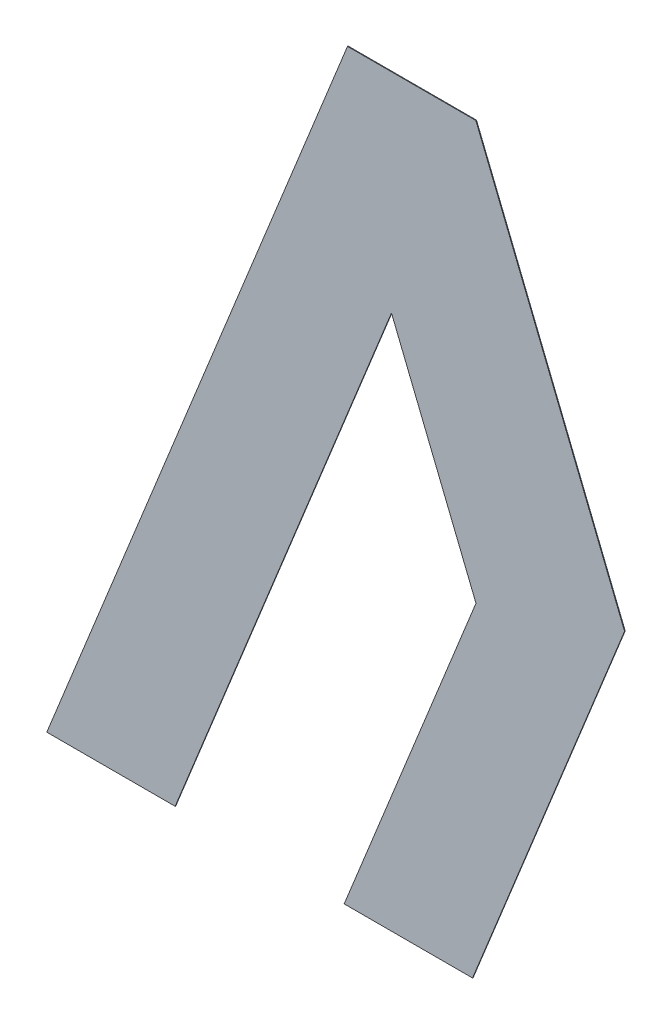
ISO-10303-21;
HEADER;
FILE_DESCRIPTION(('STEP AP214'),'2;1');
FILE_NAME('part.step','',(''),(''),'','','');
FILE_SCHEMA(('AUTOMOTIVE_DESIGN { 1 0 10303 214 1 1 1 1 }'));
ENDSEC;
DATA;
#1=APPLICATION_CONTEXT('core data for automotive mechanical design processes');
#2=APPLICATION_PROTOCOL_DEFINITION('international standard','automotive_design',2000,#1);
#3=PRODUCT_CONTEXT('',#1,'mechanical');
#4=PRODUCT('Part','Part','',(#3));
#5=PRODUCT_RELATED_PRODUCT_CATEGORY('part','',(#4));
#6=PRODUCT_DEFINITION_FORMATION('','',#4);
#7=PRODUCT_DEFINITION_CONTEXT('part definition',#1,'design');
#8=PRODUCT_DEFINITION('design','',#6,#7);
#9=PRODUCT_DEFINITION_SHAPE('','',#8);
#10=(LENGTH_UNIT() NAMED_UNIT(*) SI_UNIT(.MILLI.,.METRE.));
#11=(NAMED_UNIT(*) PLANE_ANGLE_UNIT() SI_UNIT($,.RADIAN.));
#12=(NAMED_UNIT(*) SI_UNIT($,.STERADIAN.) SOLID_ANGLE_UNIT());
#13=UNCERTAINTY_MEASURE_WITH_UNIT(LENGTH_MEASURE(1.E-05),#10,'distance_accuracy_value','');
#14=(GEOMETRIC_REPRESENTATION_CONTEXT(3) GLOBAL_UNCERTAINTY_ASSIGNED_CONTEXT((#13)) GLOBAL_UNIT_ASSIGNED_CONTEXT((#10,
#11,#12)) REPRESENTATION_CONTEXT('',''));
#15=CARTESIAN_POINT('',(0.,0.,0.));
#16=DIRECTION('',(0.,0.,1.));
#17=DIRECTION('',(1.,0.,0.));
#18=AXIS2_PLACEMENT_3D('',#15,#16,#17);
#19=CARTESIAN_POINT('',(0.542118532521683,-0.192580169588,0.0009));
#20=DIRECTION('',(0.,0.,-1.));
#21=DIRECTION('',(-1.,0.,0.));
#22=AXIS2_PLACEMENT_3D('',#19,#20,#21);
#23=PLANE('',#22);
#24=DIRECTION('',(-1.,0.,0.));
#25=VECTOR('',#24,1.);
#26=CARTESIAN_POINT('',(0.5175842831946,-0.192580169588,0.0009));
#27=LINE('',#26,#25);
#28=CARTESIAN_POINT('',(0.5175842831946,-0.192580169588,0.0009));
#29=VERTEX_POINT('',#28);
#30=CARTESIAN_POINT('',(0.497964283194566,-0.192580169588,0.0009));
#31=VERTEX_POINT('',#30);
#32=EDGE_CURVE('E11',#29,#31,#27,.T.);
#33=ORIENTED_EDGE('',*,*,#32,.T.);
#34=DIRECTION('',(0.374606593416091,0.927183854566715,0.));
#35=VECTOR('',#34,1.);
#36=CARTESIAN_POINT('',(0.497964283194567,-0.192580169588,0.0009));
#37=LINE('',#36,#35);
#38=CARTESIAN_POINT('',(0.5439263066455,-0.078820169588,0.0009));
#39=VERTEX_POINT('',#38);
#40=EDGE_CURVE('E24',#31,#39,#37,.T.);
#41=ORIENTED_EDGE('',*,*,#40,.T.);
#42=DIRECTION('',(1.,0.,0.));
#43=VECTOR('',#42,1.);
#44=CARTESIAN_POINT('',(0.5439263066455,-0.078820169588,0.0009));
#45=LINE('',#44,#43);
#46=CARTESIAN_POINT('',(0.5635463066455,-0.078820169588,0.0009));
#47=VERTEX_POINT('',#46);
#48=EDGE_CURVE('E100',#39,#47,#45,.T.);
#49=ORIENTED_EDGE('',*,*,#48,.T.);
#50=DIRECTION('',(0.374606593415527,-0.927183854566943,0.));
#51=VECTOR('',#50,1.);
#52=CARTESIAN_POINT('',(0.5635463066456,-0.078820169588,0.0009));
#53=LINE('',#52,#51);
#54=CARTESIAN_POINT('',(0.5862727818488,-0.135070169588,0.0009));
#55=VERTEX_POINT('',#54);
#56=EDGE_CURVE('E151',#47,#55,#53,.T.);
#57=ORIENTED_EDGE('',*,*,#56,.T.);
#58=DIRECTION('',(-0.37460659341618,-0.927183854566679,0.));
#59=VECTOR('',#58,1.);
#60=CARTESIAN_POINT('',(0.5862727818488,-0.135070169587998,0.0009));
#61=LINE('',#60,#59);
#62=CARTESIAN_POINT('',(0.563037233601,-0.192580169588,0.0009));
#63=VERTEX_POINT('',#62);
#64=EDGE_CURVE('E149',#55,#63,#61,.T.);
#65=ORIENTED_EDGE('',*,*,#64,.T.);
#66=DIRECTION('',(-1.,0.,0.));
#67=VECTOR('',#66,1.);
#68=CARTESIAN_POINT('',(0.563037233601,-0.192580169588,0.0009));
#69=LINE('',#68,#67);
#70=CARTESIAN_POINT('',(0.543417233601,-0.192580169588,0.0009));
#71=VERTEX_POINT('',#70);
#72=EDGE_CURVE('E147',#63,#71,#69,.T.);
#73=ORIENTED_EDGE('',*,*,#72,.T.);
#74=DIRECTION('',(0.374606593416377,0.9271838545666,0.));
#75=VECTOR('',#74,1.);
#76=CARTESIAN_POINT('',(0.543417233601,-0.192580169588,0.0009));
#77=LINE('',#76,#75);
#78=CARTESIAN_POINT('',(0.563563297758,-0.142716911045,0.0009));
#79=VERTEX_POINT('',#78);
#80=EDGE_CURVE('E145',#71,#79,#77,.T.);
#81=ORIENTED_EDGE('',*,*,#80,.T.);
#82=DIRECTION('',(-0.374606593415085,0.927183854567122,0.));
#83=VECTOR('',#82,1.);
#84=CARTESIAN_POINT('',(0.563563297758,-0.142716911045,0.0009));
#85=LINE('',#84,#83);
#86=CARTESIAN_POINT('',(0.5506468225548,-0.110747513077,0.0009));
#87=VERTEX_POINT('',#86);
#88=EDGE_CURVE('E143',#79,#87,#85,.T.);
#89=ORIENTED_EDGE('',*,*,#88,.T.);
#90=DIRECTION('',(-0.374606593415872,-0.927183854566804,0.));
#91=VECTOR('',#90,1.);
#92=CARTESIAN_POINT('',(0.5506468225548,-0.110747513077,0.0009));
#93=LINE('',#92,#91);
#94=EDGE_CURVE('E141',#87,#29,#93,.T.);
#95=ORIENTED_EDGE('',*,*,#94,.T.);
#96=EDGE_LOOP('',(#33,#41,#49,#57,#65,#73,#81,#89,#95));
#97=FACE_BOUND('',#96,.T.);
#98=ADVANCED_FACE('F17',(#97),#23,.T.);
#99=CARTESIAN_POINT('',(0.507774283194583,-0.192580169588,0.0009));
#100=DIRECTION('',(0.,-1.,0.));
#101=DIRECTION('',(0.,0.,-1.));
#102=AXIS2_PLACEMENT_3D('',#99,#100,#101);
#103=PLANE('',#102);
#104=DIRECTION('',(1.,0.,0.));
#105=VECTOR('',#104,1.);
#106=CARTESIAN_POINT('',(0.497964283194566,-0.192580169588,0.001));
#107=LINE('',#106,#105);
#108=CARTESIAN_POINT('',(0.497964283194566,-0.192580169588,0.001));
#109=VERTEX_POINT('',#108);
#110=CARTESIAN_POINT('',(0.5175842831946,-0.192580169588,0.001));
#111=VERTEX_POINT('',#110);
#112=EDGE_CURVE('E139',#109,#111,#107,.T.);
#113=ORIENTED_EDGE('',*,*,#112,.F.);
#114=DIRECTION('',(0.,0.,-1.));
#115=VECTOR('',#114,1.);
#116=CARTESIAN_POINT('',(0.497964283194566,-0.192580169588,0.001));
#117=LINE('',#116,#115);
#118=EDGE_CURVE('E105',#109,#31,#117,.T.);
#119=ORIENTED_EDGE('',*,*,#118,.T.);
#120=ORIENTED_EDGE('',*,*,#32,.F.);
#121=DIRECTION('',(0.,0.,-1.));
#122=VECTOR('',#121,1.);
#123=CARTESIAN_POINT('',(0.5175842831946,-0.192580169588,0.001));
#124=LINE('',#123,#122);
#125=EDGE_CURVE('E135',#111,#29,#124,.T.);
#126=ORIENTED_EDGE('',*,*,#125,.F.);
#127=EDGE_LOOP('',(#113,#119,#120,#126));
#128=FACE_BOUND('',#127,.T.);
#129=ADVANCED_FACE('F154',(#128),#103,.T.);
#130=CARTESIAN_POINT('',(0.5341155528747,-0.1516638413325,0.0009));
#131=DIRECTION('',(0.927183854566804,-0.374606593415872,0.));
#132=DIRECTION('',(0.,0.,-1.));
#133=AXIS2_PLACEMENT_3D('',#130,#131,#132);
#134=PLANE('',#133);
#135=DIRECTION('',(0.374606593415872,0.927183854566804,0.));
#136=VECTOR('',#135,1.);
#137=CARTESIAN_POINT('',(0.5175842831946,-0.192580169588,0.001));
#138=LINE('',#137,#136);
#139=CARTESIAN_POINT('',(0.5506468225548,-0.110747513077,0.001));
#140=VERTEX_POINT('',#139);
#141=EDGE_CURVE('E133',#111,#140,#138,.T.);
#142=ORIENTED_EDGE('',*,*,#141,.F.);
#143=ORIENTED_EDGE('',*,*,#125,.T.);
#144=ORIENTED_EDGE('',*,*,#94,.F.);
#145=DIRECTION('',(0.,0.,-1.));
#146=VECTOR('',#145,1.);
#147=CARTESIAN_POINT('',(0.5506468225548,-0.110747513077,0.001));
#148=LINE('',#147,#146);
#149=EDGE_CURVE('E130',#140,#87,#148,.T.);
#150=ORIENTED_EDGE('',*,*,#149,.F.);
#151=EDGE_LOOP('',(#142,#143,#144,#150));
#152=FACE_BOUND('',#151,.T.);
#153=ADVANCED_FACE('F161',(#152),#134,.T.);
#154=CARTESIAN_POINT('',(0.5571050601564,-0.126732212061,0.0009));
#155=DIRECTION('',(-0.927183854567122,-0.374606593415085,0.));
#156=DIRECTION('',(0.,0.,1.));
#157=AXIS2_PLACEMENT_3D('',#154,#155,#156);
#158=PLANE('',#157);
#159=DIRECTION('',(0.374606593415085,-0.927183854567122,0.));
#160=VECTOR('',#159,1.);
#161=CARTESIAN_POINT('',(0.5506468225548,-0.110747513077,0.001));
#162=LINE('',#161,#160);
#163=CARTESIAN_POINT('',(0.563563297758,-0.142716911045,0.001));
#164=VERTEX_POINT('',#163);
#165=EDGE_CURVE('E128',#140,#164,#162,.T.);
#166=ORIENTED_EDGE('',*,*,#165,.F.);
#167=ORIENTED_EDGE('',*,*,#149,.T.);
#168=ORIENTED_EDGE('',*,*,#88,.F.);
#169=DIRECTION('',(0.,0.,-1.));
#170=VECTOR('',#169,1.);
#171=CARTESIAN_POINT('',(0.563563297758,-0.142716911045,0.001));
#172=LINE('',#171,#170);
#173=EDGE_CURVE('E125',#164,#79,#172,.T.);
#174=ORIENTED_EDGE('',*,*,#173,.F.);
#175=EDGE_LOOP('',(#166,#167,#168,#174));
#176=FACE_BOUND('',#175,.T.);
#177=ADVANCED_FACE('F164',(#176),#158,.T.);
#178=CARTESIAN_POINT('',(0.5534902656795,-0.1676485403165,0.0009));
#179=DIRECTION('',(-0.9271838545666,0.374606593416377,0.));
#180=DIRECTION('',(0.,0.,1.));
#181=AXIS2_PLACEMENT_3D('',#178,#179,#180);
#182=PLANE('',#181);
#183=DIRECTION('',(-0.374606593416377,-0.9271838545666,0.));
#184=VECTOR('',#183,1.);
#185=CARTESIAN_POINT('',(0.563563297758,-0.142716911045,0.001));
#186=LINE('',#185,#184);
#187=CARTESIAN_POINT('',(0.543417233601,-0.192580169588,0.001));
#188=VERTEX_POINT('',#187);
#189=EDGE_CURVE('E123',#164,#188,#186,.T.);
#190=ORIENTED_EDGE('',*,*,#189,.F.);
#191=ORIENTED_EDGE('',*,*,#173,.T.);
#192=ORIENTED_EDGE('',*,*,#80,.F.);
#193=DIRECTION('',(0.,0.,-1.));
#194=VECTOR('',#193,1.);
#195=CARTESIAN_POINT('',(0.543417233601,-0.192580169588,0.001));
#196=LINE('',#195,#194);
#197=EDGE_CURVE('E120',#188,#71,#196,.T.);
#198=ORIENTED_EDGE('',*,*,#197,.F.);
#199=EDGE_LOOP('',(#190,#191,#192,#198));
#200=FACE_BOUND('',#199,.T.);
#201=ADVANCED_FACE('F169',(#200),#182,.T.);
#202=CARTESIAN_POINT('',(0.553227233601,-0.192580169588,0.0009));
#203=DIRECTION('',(0.,-1.,0.));
#204=DIRECTION('',(0.,0.,-1.));
#205=AXIS2_PLACEMENT_3D('',#202,#203,#204);
#206=PLANE('',#205);
#207=DIRECTION('',(1.,0.,0.));
#208=VECTOR('',#207,1.);
#209=CARTESIAN_POINT('',(0.543417233601,-0.192580169588,0.001));
#210=LINE('',#209,#208);
#211=CARTESIAN_POINT('',(0.563037233601,-0.192580169588,0.001));
#212=VERTEX_POINT('',#211);
#213=EDGE_CURVE('E118',#188,#212,#210,.T.);
#214=ORIENTED_EDGE('',*,*,#213,.F.);
#215=ORIENTED_EDGE('',*,*,#197,.T.);
#216=ORIENTED_EDGE('',*,*,#72,.F.);
#217=DIRECTION('',(0.,0.,-1.));
#218=VECTOR('',#217,1.);
#219=CARTESIAN_POINT('',(0.563037233601,-0.192580169588,0.001));
#220=LINE('',#219,#218);
#221=EDGE_CURVE('E115',#212,#63,#220,.T.);
#222=ORIENTED_EDGE('',*,*,#221,.F.);
#223=EDGE_LOOP('',(#214,#215,#216,#222));
#224=FACE_BOUND('',#223,.T.);
#225=ADVANCED_FACE('F176',(#224),#206,.T.);
#226=CARTESIAN_POINT('',(0.5746550077249,-0.163825169588,0.0009));
#227=DIRECTION('',(0.927183854566677,-0.374606593416185,0.));
#228=DIRECTION('',(0.,0.,-1.));
#229=AXIS2_PLACEMENT_3D('',#226,#227,#228);
#230=PLANE('',#229);
#231=DIRECTION('',(0.374606593416186,0.927183854566677,0.));
#232=VECTOR('',#231,1.);
#233=CARTESIAN_POINT('',(0.563037233601,-0.192580169588,0.001));
#234=LINE('',#233,#232);
#235=CARTESIAN_POINT('',(0.5862727818488,-0.135070169588,0.001));
#236=VERTEX_POINT('',#235);
#237=EDGE_CURVE('E113',#212,#236,#234,.T.);
#238=ORIENTED_EDGE('',*,*,#237,.F.);
#239=ORIENTED_EDGE('',*,*,#221,.T.);
#240=ORIENTED_EDGE('',*,*,#64,.F.);
#241=DIRECTION('',(0.,0.,-1.));
#242=VECTOR('',#241,1.);
#243=CARTESIAN_POINT('',(0.5862727818488,-0.135070169588,0.001));
#244=LINE('',#243,#242);
#245=EDGE_CURVE('E110',#236,#55,#244,.T.);
#246=ORIENTED_EDGE('',*,*,#245,.F.);
#247=EDGE_LOOP('',(#238,#239,#240,#246));
#248=FACE_BOUND('',#247,.T.);
#249=ADVANCED_FACE('F179',(#248),#230,.T.);
#250=CARTESIAN_POINT('',(0.5749095442472,-0.106945169588,0.0009));
#251=DIRECTION('',(0.927183854566945,0.374606593415521,0.));
#252=DIRECTION('',(0.,0.,-1.));
#253=AXIS2_PLACEMENT_3D('',#250,#251,#252);
#254=PLANE('',#253);
#255=DIRECTION('',(-0.374606593415521,0.927183854566945,0.));
#256=VECTOR('',#255,1.);
#257=CARTESIAN_POINT('',(0.5862727818488,-0.135070169588,0.001));
#258=LINE('',#257,#256);
#259=CARTESIAN_POINT('',(0.5635463066455,-0.078820169588,0.001));
#260=VERTEX_POINT('',#259);
#261=EDGE_CURVE('E90',#236,#260,#258,.T.);
#262=ORIENTED_EDGE('',*,*,#261,.F.);
#263=ORIENTED_EDGE('',*,*,#245,.T.);
#264=ORIENTED_EDGE('',*,*,#56,.F.);
#265=DIRECTION('',(0.,0.,-1.));
#266=VECTOR('',#265,1.);
#267=CARTESIAN_POINT('',(0.5635463066455,-0.078820169588,0.001));
#268=LINE('',#267,#266);
#269=EDGE_CURVE('E94',#260,#47,#268,.T.);
#270=ORIENTED_EDGE('',*,*,#269,.F.);
#271=EDGE_LOOP('',(#262,#263,#264,#270));
#272=FACE_BOUND('',#271,.T.);
#273=ADVANCED_FACE('F181',(#272),#254,.T.);
#274=CARTESIAN_POINT('',(0.5537363066455,-0.078820169588,0.0009));
#275=DIRECTION('',(0.,1.,0.));
#276=DIRECTION('',(0.,0.,1.));
#277=AXIS2_PLACEMENT_3D('',#274,#275,#276);
#278=PLANE('',#277);
#279=DIRECTION('',(-1.,0.,0.));
#280=VECTOR('',#279,1.);
#281=CARTESIAN_POINT('',(0.5635463066455,-0.078820169588,0.001));
#282=LINE('',#281,#280);
#283=CARTESIAN_POINT('',(0.5439263066455,-0.078820169588,0.001));
#284=VERTEX_POINT('',#283);
#285=EDGE_CURVE('E84',#260,#284,#282,.T.);
#286=ORIENTED_EDGE('',*,*,#285,.F.);
#287=ORIENTED_EDGE('',*,*,#269,.T.);
#288=ORIENTED_EDGE('',*,*,#48,.F.);
#289=DIRECTION('',(0.,0.,-1.));
#290=VECTOR('',#289,1.);
#291=CARTESIAN_POINT('',(0.5439263066455,-0.078820169588,0.001));
#292=LINE('',#291,#290);
#293=EDGE_CURVE('E95',#284,#39,#292,.T.);
#294=ORIENTED_EDGE('',*,*,#293,.F.);
#295=EDGE_LOOP('',(#286,#287,#288,#294));
#296=FACE_BOUND('',#295,.T.);
#297=ADVANCED_FACE('F99',(#296),#278,.T.);
#298=CARTESIAN_POINT('',(0.520945294920031,-0.135700169588,0.0009));
#299=DIRECTION('',(-0.927183854566987,0.374606593415418,0.));
#300=DIRECTION('',(0.,0.,1.));
#301=AXIS2_PLACEMENT_3D('',#298,#299,#300);
#302=PLANE('',#301);
#303=DIRECTION('',(-0.374606593415419,-0.927183854566987,0.));
#304=VECTOR('',#303,1.);
#305=CARTESIAN_POINT('',(0.5439263066455,-0.078820169588,0.001));
#306=LINE('',#305,#304);
#307=EDGE_CURVE('E88',#284,#109,#306,.T.);
#308=ORIENTED_EDGE('',*,*,#307,.F.);
#309=ORIENTED_EDGE('',*,*,#293,.T.);
#310=ORIENTED_EDGE('',*,*,#40,.F.);
#311=ORIENTED_EDGE('',*,*,#118,.F.);
#312=EDGE_LOOP('',(#308,#309,#310,#311));
#313=FACE_BOUND('',#312,.T.);
#314=ADVANCED_FACE('F104',(#313),#302,.T.);
#315=CARTESIAN_POINT('',(0.542118532521682,-0.192580169588,0.001));
#316=DIRECTION('',(0.,0.,-1.));
#317=DIRECTION('',(-1.,0.,0.));
#318=AXIS2_PLACEMENT_3D('',#315,#316,#317);
#319=PLANE('',#318);
#320=ORIENTED_EDGE('',*,*,#285,.T.);
#321=ORIENTED_EDGE('',*,*,#307,.T.);
#322=ORIENTED_EDGE('',*,*,#112,.T.);
#323=ORIENTED_EDGE('',*,*,#141,.T.);
#324=ORIENTED_EDGE('',*,*,#165,.T.);
#325=ORIENTED_EDGE('',*,*,#189,.T.);
#326=ORIENTED_EDGE('',*,*,#213,.T.);
#327=ORIENTED_EDGE('',*,*,#237,.T.);
#328=ORIENTED_EDGE('',*,*,#261,.T.);
#329=EDGE_LOOP('',(#320,#321,#322,#323,#324,#325,#326,#327,#328));
#330=FACE_BOUND('',#329,.T.);
#331=ADVANCED_FACE('F86',(#330),#319,.F.);
#332=CLOSED_SHELL('',(#98,#129,#153,#177,#201,#225,#249,#273,#297,#314,#331));
#333=MANIFOLD_SOLID_BREP('B1',#332);
#334=ADVANCED_BREP_SHAPE_REPRESENTATION('',(#18,#333),#14);
#335=SHAPE_DEFINITION_REPRESENTATION(#9,#334);
ENDSEC;
END-ISO-10303-21;
